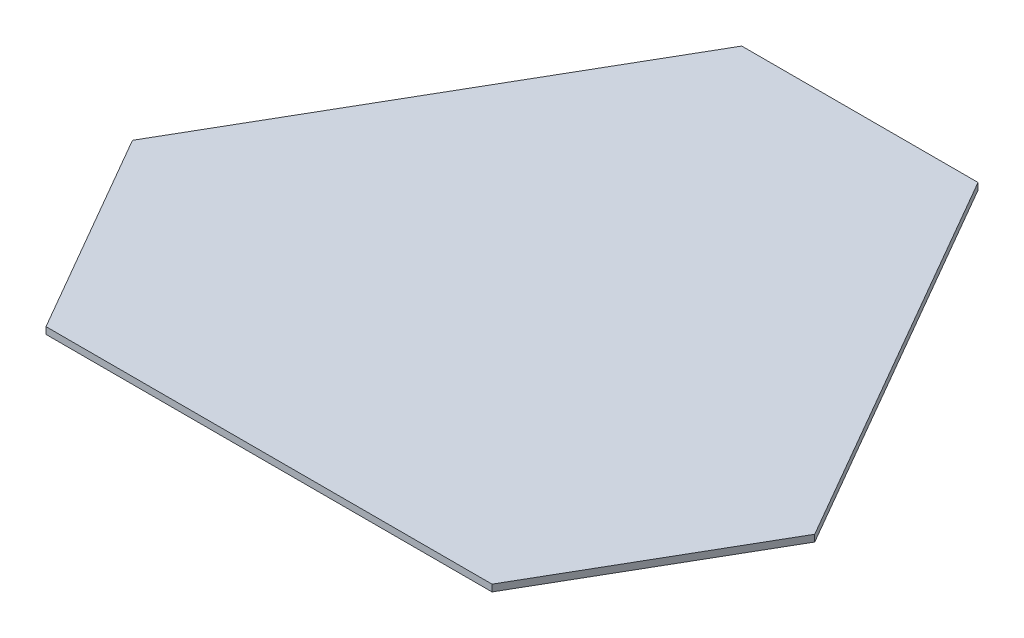
ISO-10303-21;
HEADER;
FILE_DESCRIPTION(('STEP AP214'),'2;1');
FILE_NAME('part.step','',(''),(''),'','','');
FILE_SCHEMA(('AUTOMOTIVE_DESIGN { 1 0 10303 214 1 1 1 1 }'));
ENDSEC;
DATA;
#1=APPLICATION_CONTEXT('core data for automotive mechanical design processes');
#2=APPLICATION_PROTOCOL_DEFINITION('international standard','automotive_design',2000,#1);
#3=PRODUCT_CONTEXT('',#1,'mechanical');
#4=PRODUCT('Part','Part','',(#3));
#5=PRODUCT_RELATED_PRODUCT_CATEGORY('part','',(#4));
#6=PRODUCT_DEFINITION_FORMATION('','',#4);
#7=PRODUCT_DEFINITION_CONTEXT('part definition',#1,'design');
#8=PRODUCT_DEFINITION('design','',#6,#7);
#9=PRODUCT_DEFINITION_SHAPE('','',#8);
#10=(LENGTH_UNIT() NAMED_UNIT(*) SI_UNIT(.MILLI.,.METRE.));
#11=(NAMED_UNIT(*) PLANE_ANGLE_UNIT() SI_UNIT($,.RADIAN.));
#12=(NAMED_UNIT(*) SI_UNIT($,.STERADIAN.) SOLID_ANGLE_UNIT());
#13=UNCERTAINTY_MEASURE_WITH_UNIT(LENGTH_MEASURE(1.E-05),#10,'distance_accuracy_value','');
#14=(GEOMETRIC_REPRESENTATION_CONTEXT(3) GLOBAL_UNCERTAINTY_ASSIGNED_CONTEXT((#13)) GLOBAL_UNIT_ASSIGNED_CONTEXT((#10,
#11,#12)) REPRESENTATION_CONTEXT('',''));
#15=CARTESIAN_POINT('',(0.,0.,0.));
#16=DIRECTION('',(0.,0.,1.));
#17=DIRECTION('',(1.,0.,0.));
#18=AXIS2_PLACEMENT_3D('',#15,#16,#17);
#19=CARTESIAN_POINT('',(-151.171989963117,3.,70.1388374866107));
#20=DIRECTION('',(0.866025403784438,0.,-0.500000000000001));
#21=DIRECTION('',(-0.500000000000001,0.,-0.866025403784438));
#22=AXIS2_PLACEMENT_3D('',#19,#20,#21);
#23=PLANE('',#22);
#24=DIRECTION('',(0.500000000000001,0.,0.866025403784438));
#25=VECTOR('',#24,1.);
#26=CARTESIAN_POINT('',(-151.171989963117,0.,70.1388374866107));
#27=LINE('',#26,#25);
#28=CARTESIAN_POINT('',(-151.171989963117,0.,70.1388374866107));
#29=VERTEX_POINT('',#28);
#30=CARTESIAN_POINT('',(-98.8280100368749,0.,160.801270189226));
#31=VERTEX_POINT('',#30);
#32=EDGE_CURVE('E118',#29,#31,#27,.T.);
#33=ORIENTED_EDGE('',*,*,#32,.T.);
#34=DIRECTION('',(0.,-1.,0.));
#35=VECTOR('',#34,1.);
#36=CARTESIAN_POINT('',(-98.8280100368749,3.,160.801270189226));
#37=LINE('',#36,#35);
#38=CARTESIAN_POINT('',(-98.8280100368749,3.,160.801270189226));
#39=VERTEX_POINT('',#38);
#40=EDGE_CURVE('E11',#39,#31,#37,.T.);
#41=ORIENTED_EDGE('',*,*,#40,.F.);
#42=DIRECTION('',(0.500000000000001,0.,0.866025403784438));
#43=VECTOR('',#42,1.);
#44=CARTESIAN_POINT('',(-151.171989963117,3.,70.1388374866107));
#45=LINE('',#44,#43);
#46=CARTESIAN_POINT('',(-151.171989963117,3.,70.1388374866107));
#47=VERTEX_POINT('',#46);
#48=EDGE_CURVE('E128',#47,#39,#45,.T.);
#49=ORIENTED_EDGE('',*,*,#48,.F.);
#50=DIRECTION('',(0.,-1.,0.));
#51=VECTOR('',#50,1.);
#52=CARTESIAN_POINT('',(-151.171989963117,3.,70.1388374866107));
#53=LINE('',#52,#51);
#54=EDGE_CURVE('E114',#47,#29,#53,.T.);
#55=ORIENTED_EDGE('',*,*,#54,.T.);
#56=EDGE_LOOP('',(#33,#41,#49,#55));
#57=FACE_BOUND('',#56,.T.);
#58=ADVANCED_FACE('F34',(#57),#23,.F.);
#59=CARTESIAN_POINT('',(98.8280100368828,3.,160.801270189227));
#60=DIRECTION('',(0.,0.,-1.));
#61=DIRECTION('',(-1.,0.,0.));
#62=AXIS2_PLACEMENT_3D('',#59,#60,#61);
#63=PLANE('',#62);
#64=DIRECTION('',(1.,0.,0.));
#65=VECTOR('',#64,1.);
#66=CARTESIAN_POINT('',(98.8280100368828,0.,160.801270189227));
#67=LINE('',#66,#65);
#68=CARTESIAN_POINT('',(98.8280100368828,0.,160.801270189227));
#69=VERTEX_POINT('',#68);
#70=EDGE_CURVE('E121',#31,#69,#67,.T.);
#71=ORIENTED_EDGE('',*,*,#70,.T.);
#72=DIRECTION('',(0.,-1.,0.));
#73=VECTOR('',#72,1.);
#74=CARTESIAN_POINT('',(98.8280100368828,3.,160.801270189227));
#75=LINE('',#74,#73);
#76=CARTESIAN_POINT('',(98.8280100368828,3.,160.801270189227));
#77=VERTEX_POINT('',#76);
#78=EDGE_CURVE('E42',#77,#69,#75,.T.);
#79=ORIENTED_EDGE('',*,*,#78,.F.);
#80=DIRECTION('',(1.,0.,0.));
#81=VECTOR('',#80,1.);
#82=CARTESIAN_POINT('',(98.8280100368828,3.,160.801270189227));
#83=LINE('',#82,#81);
#84=EDGE_CURVE('E87',#39,#77,#83,.T.);
#85=ORIENTED_EDGE('',*,*,#84,.F.);
#86=ORIENTED_EDGE('',*,*,#40,.T.);
#87=EDGE_LOOP('',(#71,#79,#85,#86));
#88=FACE_BOUND('',#87,.T.);
#89=ADVANCED_FACE('F152',(#88),#63,.F.);
#90=CARTESIAN_POINT('',(98.8280100368828,3.,160.801270189227));
#91=DIRECTION('',(-0.866025403784435,0.,-0.500000000000007));
#92=DIRECTION('',(-0.500000000000007,0.,0.866025403784435));
#93=AXIS2_PLACEMENT_3D('',#90,#91,#92);
#94=PLANE('',#93);
#95=DIRECTION('',(0.500000000000007,0.,-0.866025403784435));
#96=VECTOR('',#95,1.);
#97=CARTESIAN_POINT('',(98.8280100368828,0.,160.801270189227));
#98=LINE('',#97,#96);
#99=CARTESIAN_POINT('',(151.171989963126,0.,70.1388374866107));
#100=VERTEX_POINT('',#99);
#101=EDGE_CURVE('E123',#69,#100,#98,.T.);
#102=ORIENTED_EDGE('',*,*,#101,.T.);
#103=DIRECTION('',(0.,-1.,0.));
#104=VECTOR('',#103,1.);
#105=CARTESIAN_POINT('',(151.171989963126,3.,70.1388374866107));
#106=LINE('',#105,#104);
#107=CARTESIAN_POINT('',(151.171989963126,3.,70.1388374866107));
#108=VERTEX_POINT('',#107);
#109=EDGE_CURVE('E109',#108,#100,#106,.T.);
#110=ORIENTED_EDGE('',*,*,#109,.F.);
#111=DIRECTION('',(0.500000000000007,0.,-0.866025403784435));
#112=VECTOR('',#111,1.);
#113=CARTESIAN_POINT('',(98.8280100368828,3.,160.801270189227));
#114=LINE('',#113,#112);
#115=EDGE_CURVE('E100',#77,#108,#114,.T.);
#116=ORIENTED_EDGE('',*,*,#115,.F.);
#117=ORIENTED_EDGE('',*,*,#78,.T.);
#118=EDGE_LOOP('',(#102,#110,#116,#117));
#119=FACE_BOUND('',#118,.T.);
#120=ADVANCED_FACE('F134',(#119),#94,.F.);
#121=CARTESIAN_POINT('',(151.171989963126,3.,70.1388374866107));
#122=DIRECTION('',(-0.866025403784439,0.,0.5));
#123=DIRECTION('',(0.5,0.,0.866025403784439));
#124=AXIS2_PLACEMENT_3D('',#121,#122,#123);
#125=PLANE('',#124);
#126=DIRECTION('',(-0.5,0.,-0.866025403784439));
#127=VECTOR('',#126,1.);
#128=CARTESIAN_POINT('',(151.171989963126,0.,70.1388374866107));
#129=LINE('',#128,#127);
#130=CARTESIAN_POINT('',(52.3439799262465,0.,-101.036297108191));
#131=VERTEX_POINT('',#130);
#132=EDGE_CURVE('E108',#100,#131,#129,.T.);
#133=ORIENTED_EDGE('',*,*,#132,.T.);
#134=DIRECTION('',(0.,-1.,0.));
#135=VECTOR('',#134,1.);
#136=CARTESIAN_POINT('',(52.3439799262465,3.,-101.036297108191));
#137=LINE('',#136,#135);
#138=CARTESIAN_POINT('',(52.3439799262465,3.,-101.036297108191));
#139=VERTEX_POINT('',#138);
#140=EDGE_CURVE('E105',#139,#131,#137,.T.);
#141=ORIENTED_EDGE('',*,*,#140,.F.);
#142=DIRECTION('',(-0.5,0.,-0.866025403784439));
#143=VECTOR('',#142,1.);
#144=CARTESIAN_POINT('',(151.171989963126,3.,70.1388374866107));
#145=LINE('',#144,#143);
#146=EDGE_CURVE('E94',#108,#139,#145,.T.);
#147=ORIENTED_EDGE('',*,*,#146,.F.);
#148=ORIENTED_EDGE('',*,*,#109,.T.);
#149=EDGE_LOOP('',(#133,#141,#147,#148));
#150=FACE_BOUND('',#149,.T.);
#151=ADVANCED_FACE('F106',(#150),#125,.F.);
#152=CARTESIAN_POINT('',(-52.3439799262375,3.,-101.036297108191));
#153=DIRECTION('',(0.,0.,1.));
#154=DIRECTION('',(1.,0.,0.));
#155=AXIS2_PLACEMENT_3D('',#152,#153,#154);
#156=PLANE('',#155);
#157=DIRECTION('',(-1.,0.,0.));
#158=VECTOR('',#157,1.);
#159=CARTESIAN_POINT('',(-52.3439799262375,0.,-101.036297108191));
#160=LINE('',#159,#158);
#161=CARTESIAN_POINT('',(-52.3439799262375,0.,-101.036297108191));
#162=VERTEX_POINT('',#161);
#163=EDGE_CURVE('E73',#131,#162,#160,.T.);
#164=ORIENTED_EDGE('',*,*,#163,.T.);
#165=DIRECTION('',(0.,-1.,0.));
#166=VECTOR('',#165,1.);
#167=CARTESIAN_POINT('',(-52.3439799262375,3.,-101.036297108191));
#168=LINE('',#167,#166);
#169=CARTESIAN_POINT('',(-52.3439799262375,3.,-101.036297108191));
#170=VERTEX_POINT('',#169);
#171=EDGE_CURVE('E110',#170,#162,#168,.T.);
#172=ORIENTED_EDGE('',*,*,#171,.F.);
#173=DIRECTION('',(-1.,0.,0.));
#174=VECTOR('',#173,1.);
#175=CARTESIAN_POINT('',(-52.3439799262375,3.,-101.036297108191));
#176=LINE('',#175,#174);
#177=EDGE_CURVE('E98',#139,#170,#176,.T.);
#178=ORIENTED_EDGE('',*,*,#177,.F.);
#179=ORIENTED_EDGE('',*,*,#140,.T.);
#180=EDGE_LOOP('',(#164,#172,#178,#179));
#181=FACE_BOUND('',#180,.T.);
#182=ADVANCED_FACE('F112',(#181),#156,.F.);
#183=CARTESIAN_POINT('',(-151.171989963117,3.,70.1388374866107));
#184=DIRECTION('',(0.866025403784439,0.,0.5));
#185=DIRECTION('',(0.5,0.,-0.866025403784439));
#186=AXIS2_PLACEMENT_3D('',#183,#184,#185);
#187=PLANE('',#186);
#188=DIRECTION('',(-0.5,0.,0.866025403784439));
#189=VECTOR('',#188,1.);
#190=CARTESIAN_POINT('',(-151.171989963117,0.,70.1388374866107));
#191=LINE('',#190,#189);
#192=EDGE_CURVE('E79',#162,#29,#191,.T.);
#193=ORIENTED_EDGE('',*,*,#192,.T.);
#194=ORIENTED_EDGE('',*,*,#54,.F.);
#195=DIRECTION('',(-0.5,0.,0.866025403784439));
#196=VECTOR('',#195,1.);
#197=CARTESIAN_POINT('',(-151.171989963117,3.,70.1388374866107));
#198=LINE('',#197,#196);
#199=EDGE_CURVE('E50',#170,#47,#198,.T.);
#200=ORIENTED_EDGE('',*,*,#199,.F.);
#201=ORIENTED_EDGE('',*,*,#171,.T.);
#202=EDGE_LOOP('',(#193,#194,#200,#201));
#203=FACE_BOUND('',#202,.T.);
#204=ADVANCED_FACE('F141',(#203),#187,.F.);
#205=CARTESIAN_POINT('',(0.,3.,0.));
#206=DIRECTION('',(0.,-1.,0.));
#207=DIRECTION('',(0.,0.,-1.));
#208=AXIS2_PLACEMENT_3D('',#205,#206,#207);
#209=PLANE('',#208);
#210=ORIENTED_EDGE('',*,*,#48,.T.);
#211=ORIENTED_EDGE('',*,*,#84,.T.);
#212=ORIENTED_EDGE('',*,*,#115,.T.);
#213=ORIENTED_EDGE('',*,*,#146,.T.);
#214=ORIENTED_EDGE('',*,*,#177,.T.);
#215=ORIENTED_EDGE('',*,*,#199,.T.);
#216=EDGE_LOOP('',(#210,#211,#212,#213,#214,#215));
#217=FACE_BOUND('',#216,.T.);
#218=ADVANCED_FACE('F96',(#217),#209,.F.);
#219=CARTESIAN_POINT('',(0.,0.,0.));
#220=DIRECTION('',(0.,-1.,0.));
#221=DIRECTION('',(0.,0.,-1.));
#222=AXIS2_PLACEMENT_3D('',#219,#220,#221);
#223=PLANE('',#222);
#224=ORIENTED_EDGE('',*,*,#32,.F.);
#225=ORIENTED_EDGE('',*,*,#192,.F.);
#226=ORIENTED_EDGE('',*,*,#163,.F.);
#227=ORIENTED_EDGE('',*,*,#132,.F.);
#228=ORIENTED_EDGE('',*,*,#101,.F.);
#229=ORIENTED_EDGE('',*,*,#70,.F.);
#230=EDGE_LOOP('',(#224,#225,#226,#227,#228,#229));
#231=FACE_BOUND('',#230,.T.);
#232=ADVANCED_FACE('F137',(#231),#223,.T.);
#233=CLOSED_SHELL('',(#58,#89,#120,#151,#182,#204,#218,#232));
#234=MANIFOLD_SOLID_BREP('B2',#233);
#235=ADVANCED_BREP_SHAPE_REPRESENTATION('',(#18,#234),#14);
#236=SHAPE_DEFINITION_REPRESENTATION(#9,#235);
ENDSEC;
END-ISO-10303-21;
